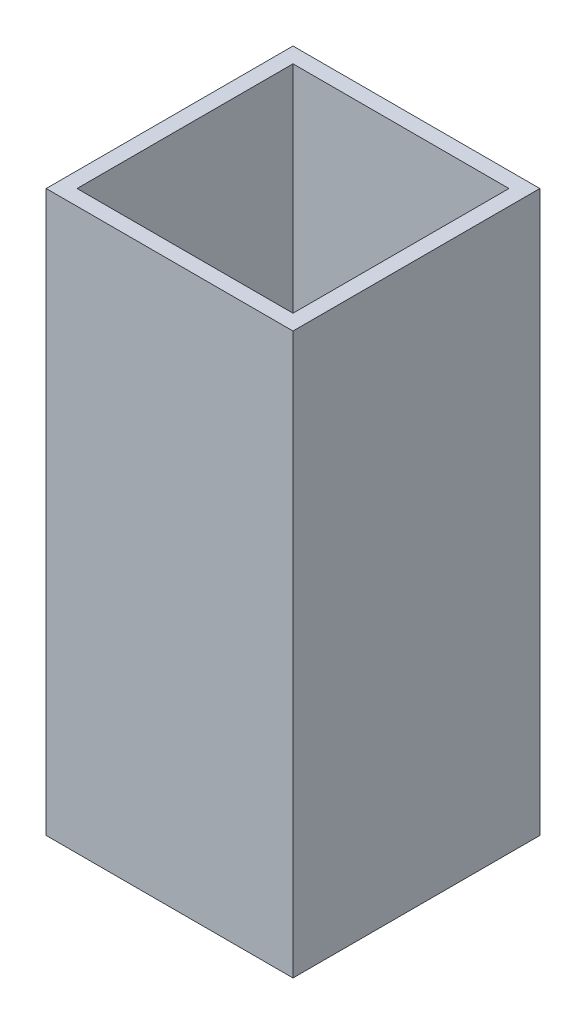
ISO-10303-21;
HEADER;
FILE_DESCRIPTION(('STEP AP214'),'2;1');
FILE_NAME('part.step','',(''),(''),'','','');
FILE_SCHEMA(('AUTOMOTIVE_DESIGN { 1 0 10303 214 1 1 1 1 }'));
ENDSEC;
DATA;
#1=APPLICATION_CONTEXT('core data for automotive mechanical design processes');
#2=APPLICATION_PROTOCOL_DEFINITION('international standard','automotive_design',2000,#1);
#3=PRODUCT_CONTEXT('',#1,'mechanical');
#4=PRODUCT('Part','Part','',(#3));
#5=PRODUCT_RELATED_PRODUCT_CATEGORY('part','',(#4));
#6=PRODUCT_DEFINITION_FORMATION('','',#4);
#7=PRODUCT_DEFINITION_CONTEXT('part definition',#1,'design');
#8=PRODUCT_DEFINITION('design','',#6,#7);
#9=PRODUCT_DEFINITION_SHAPE('','',#8);
#10=(LENGTH_UNIT() NAMED_UNIT(*) SI_UNIT(.MILLI.,.METRE.));
#11=(NAMED_UNIT(*) PLANE_ANGLE_UNIT() SI_UNIT($,.RADIAN.));
#12=(NAMED_UNIT(*) SI_UNIT($,.STERADIAN.) SOLID_ANGLE_UNIT());
#13=UNCERTAINTY_MEASURE_WITH_UNIT(LENGTH_MEASURE(1.E-05),#10,'distance_accuracy_value','');
#14=(GEOMETRIC_REPRESENTATION_CONTEXT(3) GLOBAL_UNCERTAINTY_ASSIGNED_CONTEXT((#13)) GLOBAL_UNIT_ASSIGNED_CONTEXT((#10,
#11,#12)) REPRESENTATION_CONTEXT('',''));
#15=CARTESIAN_POINT('',(0.,0.,0.));
#16=DIRECTION('',(0.,0.,1.));
#17=DIRECTION('',(1.,0.,0.));
#18=AXIS2_PLACEMENT_3D('',#15,#16,#17);
#19=CARTESIAN_POINT('',(0.,57.658,0.));
#20=DIRECTION('',(0.,-1.,0.));
#21=DIRECTION('',(0.,0.,-1.));
#22=AXIS2_PLACEMENT_3D('',#19,#20,#21);
#23=PLANE('',#22);
#24=DIRECTION('',(0.,0.,-1.));
#25=VECTOR('',#24,1.);
#26=CARTESIAN_POINT('',(12.7,57.658,12.7));
#27=LINE('',#26,#25);
#28=CARTESIAN_POINT('',(12.7,57.658,12.7));
#29=VERTEX_POINT('',#28);
#30=CARTESIAN_POINT('',(12.7,57.658,-12.7));
#31=VERTEX_POINT('',#30);
#32=EDGE_CURVE('E136',#29,#31,#27,.T.);
#33=ORIENTED_EDGE('',*,*,#32,.T.);
#34=DIRECTION('',(-1.,0.,0.));
#35=VECTOR('',#34,1.);
#36=CARTESIAN_POINT('',(-12.7,57.658,-12.7));
#37=LINE('',#36,#35);
#38=CARTESIAN_POINT('',(-12.7,57.658,-12.7));
#39=VERTEX_POINT('',#38);
#40=EDGE_CURVE('E139',#31,#39,#37,.T.);
#41=ORIENTED_EDGE('',*,*,#40,.T.);
#42=DIRECTION('',(0.,0.,1.));
#43=VECTOR('',#42,1.);
#44=CARTESIAN_POINT('',(-12.7,57.658,12.7));
#45=LINE('',#44,#43);
#46=CARTESIAN_POINT('',(-12.7,57.658,12.7));
#47=VERTEX_POINT('',#46);
#48=EDGE_CURVE('E142',#39,#47,#45,.T.);
#49=ORIENTED_EDGE('',*,*,#48,.T.);
#50=DIRECTION('',(1.,0.,0.));
#51=VECTOR('',#50,1.);
#52=CARTESIAN_POINT('',(-12.7,57.658,12.7));
#53=LINE('',#52,#51);
#54=EDGE_CURVE('E144',#47,#29,#53,.T.);
#55=ORIENTED_EDGE('',*,*,#54,.T.);
#56=EDGE_LOOP('',(#33,#41,#49,#55));
#57=FACE_BOUND('',#56,.T.);
#58=DIRECTION('',(0.,0.,-1.));
#59=VECTOR('',#58,1.);
#60=CARTESIAN_POINT('',(11.1125,57.658,11.1125));
#61=LINE('',#60,#59);
#62=CARTESIAN_POINT('',(11.1125,57.658,11.1125));
#63=VERTEX_POINT('',#62);
#64=CARTESIAN_POINT('',(11.1125,57.658,-11.1125));
#65=VERTEX_POINT('',#64);
#66=EDGE_CURVE('E100',#63,#65,#61,.T.);
#67=ORIENTED_EDGE('',*,*,#66,.F.);
#68=DIRECTION('',(1.,0.,0.));
#69=VECTOR('',#68,1.);
#70=CARTESIAN_POINT('',(-11.1125,57.658,11.1125));
#71=LINE('',#70,#69);
#72=CARTESIAN_POINT('',(-11.1125,57.658,11.1125));
#73=VERTEX_POINT('',#72);
#74=EDGE_CURVE('E122',#73,#63,#71,.T.);
#75=ORIENTED_EDGE('',*,*,#74,.F.);
#76=DIRECTION('',(0.,0.,1.));
#77=VECTOR('',#76,1.);
#78=CARTESIAN_POINT('',(-11.1125,57.658,11.1125));
#79=LINE('',#78,#77);
#80=CARTESIAN_POINT('',(-11.1125,57.658,-11.1125));
#81=VERTEX_POINT('',#80);
#82=EDGE_CURVE('E120',#81,#73,#79,.T.);
#83=ORIENTED_EDGE('',*,*,#82,.F.);
#84=DIRECTION('',(-1.,0.,0.));
#85=VECTOR('',#84,1.);
#86=CARTESIAN_POINT('',(-11.1125,57.658,-11.1125));
#87=LINE('',#86,#85);
#88=EDGE_CURVE('E108',#65,#81,#87,.T.);
#89=ORIENTED_EDGE('',*,*,#88,.F.);
#90=EDGE_LOOP('',(#67,#75,#83,#89));
#91=FACE_BOUND('',#90,.T.);
#92=ADVANCED_FACE('F35',(#57,#91),#23,.F.);
#93=CARTESIAN_POINT('',(0.,0.,0.));
#94=DIRECTION('',(0.,-1.,0.));
#95=DIRECTION('',(0.,0.,-1.));
#96=AXIS2_PLACEMENT_3D('',#93,#94,#95);
#97=PLANE('',#96);
#98=DIRECTION('',(0.,0.,-1.));
#99=VECTOR('',#98,1.);
#100=CARTESIAN_POINT('',(12.7,0.,12.7));
#101=LINE('',#100,#99);
#102=CARTESIAN_POINT('',(12.7,0.,12.7));
#103=VERTEX_POINT('',#102);
#104=CARTESIAN_POINT('',(12.7,0.,-12.7));
#105=VERTEX_POINT('',#104);
#106=EDGE_CURVE('E116',#103,#105,#101,.T.);
#107=ORIENTED_EDGE('',*,*,#106,.F.);
#108=DIRECTION('',(1.,0.,0.));
#109=VECTOR('',#108,1.);
#110=CARTESIAN_POINT('',(-12.7,0.,12.7));
#111=LINE('',#110,#109);
#112=CARTESIAN_POINT('',(-12.7,0.,12.7));
#113=VERTEX_POINT('',#112);
#114=EDGE_CURVE('E140',#113,#103,#111,.T.);
#115=ORIENTED_EDGE('',*,*,#114,.F.);
#116=DIRECTION('',(0.,0.,1.));
#117=VECTOR('',#116,1.);
#118=CARTESIAN_POINT('',(-12.7,0.,12.7));
#119=LINE('',#118,#117);
#120=CARTESIAN_POINT('',(-12.7,0.,-12.7));
#121=VERTEX_POINT('',#120);
#122=EDGE_CURVE('E151',#121,#113,#119,.T.);
#123=ORIENTED_EDGE('',*,*,#122,.F.);
#124=DIRECTION('',(-1.,0.,0.));
#125=VECTOR('',#124,1.);
#126=CARTESIAN_POINT('',(-12.7,0.,-12.7));
#127=LINE('',#126,#125);
#128=EDGE_CURVE('E149',#105,#121,#127,.T.);
#129=ORIENTED_EDGE('',*,*,#128,.F.);
#130=EDGE_LOOP('',(#107,#115,#123,#129));
#131=FACE_BOUND('',#130,.T.);
#132=DIRECTION('',(1.,0.,0.));
#133=VECTOR('',#132,1.);
#134=CARTESIAN_POINT('',(-11.1125,0.,11.1125));
#135=LINE('',#134,#133);
#136=CARTESIAN_POINT('',(-11.1125,0.,11.1125));
#137=VERTEX_POINT('',#136);
#138=CARTESIAN_POINT('',(11.1125,0.,11.1125));
#139=VERTEX_POINT('',#138);
#140=EDGE_CURVE('E109',#137,#139,#135,.T.);
#141=ORIENTED_EDGE('',*,*,#140,.T.);
#142=DIRECTION('',(0.,0.,-1.));
#143=VECTOR('',#142,1.);
#144=CARTESIAN_POINT('',(11.1125,0.,11.1125));
#145=LINE('',#144,#143);
#146=CARTESIAN_POINT('',(11.1125,0.,-11.1125));
#147=VERTEX_POINT('',#146);
#148=EDGE_CURVE('E58',#139,#147,#145,.T.);
#149=ORIENTED_EDGE('',*,*,#148,.T.);
#150=DIRECTION('',(-1.,0.,0.));
#151=VECTOR('',#150,1.);
#152=CARTESIAN_POINT('',(-11.1125,0.,-11.1125));
#153=LINE('',#152,#151);
#154=CARTESIAN_POINT('',(-11.1125,0.,-11.1125));
#155=VERTEX_POINT('',#154);
#156=EDGE_CURVE('E115',#147,#155,#153,.T.);
#157=ORIENTED_EDGE('',*,*,#156,.T.);
#158=DIRECTION('',(0.,0.,1.));
#159=VECTOR('',#158,1.);
#160=CARTESIAN_POINT('',(-11.1125,0.,11.1125));
#161=LINE('',#160,#159);
#162=EDGE_CURVE('E128',#155,#137,#161,.T.);
#163=ORIENTED_EDGE('',*,*,#162,.T.);
#164=EDGE_LOOP('',(#141,#149,#157,#163));
#165=FACE_BOUND('',#164,.T.);
#166=ADVANCED_FACE('F169',(#131,#165),#97,.T.);
#167=CARTESIAN_POINT('',(12.7,57.658,12.7));
#168=DIRECTION('',(-1.,0.,0.));
#169=DIRECTION('',(0.,0.,1.));
#170=AXIS2_PLACEMENT_3D('',#167,#168,#169);
#171=PLANE('',#170);
#172=ORIENTED_EDGE('',*,*,#106,.T.);
#173=DIRECTION('',(0.,-1.,0.));
#174=VECTOR('',#173,1.);
#175=CARTESIAN_POINT('',(12.7,57.658,-12.7));
#176=LINE('',#175,#174);
#177=EDGE_CURVE('E11',#31,#105,#176,.T.);
#178=ORIENTED_EDGE('',*,*,#177,.F.);
#179=ORIENTED_EDGE('',*,*,#32,.F.);
#180=DIRECTION('',(0.,-1.,0.));
#181=VECTOR('',#180,1.);
#182=CARTESIAN_POINT('',(12.7,57.658,12.7));
#183=LINE('',#182,#181);
#184=EDGE_CURVE('E146',#29,#103,#183,.T.);
#185=ORIENTED_EDGE('',*,*,#184,.T.);
#186=EDGE_LOOP('',(#172,#178,#179,#185));
#187=FACE_BOUND('',#186,.T.);
#188=ADVANCED_FACE('F37',(#187),#171,.F.);
#189=CARTESIAN_POINT('',(-12.7,57.658,-12.7));
#190=DIRECTION('',(0.,0.,1.));
#191=DIRECTION('',(1.,0.,0.));
#192=AXIS2_PLACEMENT_3D('',#189,#190,#191);
#193=PLANE('',#192);
#194=ORIENTED_EDGE('',*,*,#128,.T.);
#195=DIRECTION('',(0.,-1.,0.));
#196=VECTOR('',#195,1.);
#197=CARTESIAN_POINT('',(-12.7,57.658,-12.7));
#198=LINE('',#197,#196);
#199=EDGE_CURVE('E43',#39,#121,#198,.T.);
#200=ORIENTED_EDGE('',*,*,#199,.F.);
#201=ORIENTED_EDGE('',*,*,#40,.F.);
#202=ORIENTED_EDGE('',*,*,#177,.T.);
#203=EDGE_LOOP('',(#194,#200,#201,#202));
#204=FACE_BOUND('',#203,.T.);
#205=ADVANCED_FACE('F179',(#204),#193,.F.);
#206=CARTESIAN_POINT('',(-12.7,57.658,12.7));
#207=DIRECTION('',(1.,0.,0.));
#208=DIRECTION('',(0.,0.,-1.));
#209=AXIS2_PLACEMENT_3D('',#206,#207,#208);
#210=PLANE('',#209);
#211=ORIENTED_EDGE('',*,*,#122,.T.);
#212=DIRECTION('',(0.,-1.,0.));
#213=VECTOR('',#212,1.);
#214=CARTESIAN_POINT('',(-12.7,57.658,12.7));
#215=LINE('',#214,#213);
#216=EDGE_CURVE('E156',#47,#113,#215,.T.);
#217=ORIENTED_EDGE('',*,*,#216,.F.);
#218=ORIENTED_EDGE('',*,*,#48,.F.);
#219=ORIENTED_EDGE('',*,*,#199,.T.);
#220=EDGE_LOOP('',(#211,#217,#218,#219));
#221=FACE_BOUND('',#220,.T.);
#222=ADVANCED_FACE('F163',(#221),#210,.F.);
#223=CARTESIAN_POINT('',(-12.7,57.658,12.7));
#224=DIRECTION('',(0.,0.,-1.));
#225=DIRECTION('',(-1.,0.,0.));
#226=AXIS2_PLACEMENT_3D('',#223,#224,#225);
#227=PLANE('',#226);
#228=ORIENTED_EDGE('',*,*,#114,.T.);
#229=ORIENTED_EDGE('',*,*,#184,.F.);
#230=ORIENTED_EDGE('',*,*,#54,.F.);
#231=ORIENTED_EDGE('',*,*,#216,.T.);
#232=EDGE_LOOP('',(#228,#229,#230,#231));
#233=FACE_BOUND('',#232,.T.);
#234=ADVANCED_FACE('F173',(#233),#227,.F.);
#235=CARTESIAN_POINT('',(11.1125,57.658,11.1125));
#236=DIRECTION('',(-1.,0.,0.));
#237=DIRECTION('',(0.,0.,1.));
#238=AXIS2_PLACEMENT_3D('',#235,#236,#237);
#239=PLANE('',#238);
#240=ORIENTED_EDGE('',*,*,#148,.F.);
#241=DIRECTION('',(0.,-1.,0.));
#242=VECTOR('',#241,1.);
#243=CARTESIAN_POINT('',(11.1125,57.658,11.1125));
#244=LINE('',#243,#242);
#245=EDGE_CURVE('E104',#63,#139,#244,.T.);
#246=ORIENTED_EDGE('',*,*,#245,.F.);
#247=ORIENTED_EDGE('',*,*,#66,.T.);
#248=DIRECTION('',(0.,-1.,0.));
#249=VECTOR('',#248,1.);
#250=CARTESIAN_POINT('',(11.1125,57.658,-11.1125));
#251=LINE('',#250,#249);
#252=EDGE_CURVE('E103',#65,#147,#251,.T.);
#253=ORIENTED_EDGE('',*,*,#252,.T.);
#254=EDGE_LOOP('',(#240,#246,#247,#253));
#255=FACE_BOUND('',#254,.T.);
#256=ADVANCED_FACE('F102',(#255),#239,.T.);
#257=CARTESIAN_POINT('',(-11.1125,57.658,-11.1125));
#258=DIRECTION('',(0.,0.,1.));
#259=DIRECTION('',(1.,0.,0.));
#260=AXIS2_PLACEMENT_3D('',#257,#258,#259);
#261=PLANE('',#260);
#262=ORIENTED_EDGE('',*,*,#156,.F.);
#263=ORIENTED_EDGE('',*,*,#252,.F.);
#264=ORIENTED_EDGE('',*,*,#88,.T.);
#265=DIRECTION('',(0.,-1.,0.));
#266=VECTOR('',#265,1.);
#267=CARTESIAN_POINT('',(-11.1125,57.658,-11.1125));
#268=LINE('',#267,#266);
#269=EDGE_CURVE('E117',#81,#155,#268,.T.);
#270=ORIENTED_EDGE('',*,*,#269,.T.);
#271=EDGE_LOOP('',(#262,#263,#264,#270));
#272=FACE_BOUND('',#271,.T.);
#273=ADVANCED_FACE('F112',(#272),#261,.T.);
#274=CARTESIAN_POINT('',(-11.1125,57.658,11.1125));
#275=DIRECTION('',(1.,0.,0.));
#276=DIRECTION('',(0.,0.,-1.));
#277=AXIS2_PLACEMENT_3D('',#274,#275,#276);
#278=PLANE('',#277);
#279=ORIENTED_EDGE('',*,*,#162,.F.);
#280=ORIENTED_EDGE('',*,*,#269,.F.);
#281=ORIENTED_EDGE('',*,*,#82,.T.);
#282=DIRECTION('',(0.,-1.,0.));
#283=VECTOR('',#282,1.);
#284=CARTESIAN_POINT('',(-11.1125,57.658,11.1125));
#285=LINE('',#284,#283);
#286=EDGE_CURVE('E50',#73,#137,#285,.T.);
#287=ORIENTED_EDGE('',*,*,#286,.T.);
#288=EDGE_LOOP('',(#279,#280,#281,#287));
#289=FACE_BOUND('',#288,.T.);
#290=ADVANCED_FACE('F202',(#289),#278,.T.);
#291=CARTESIAN_POINT('',(-11.1125,57.658,11.1125));
#292=DIRECTION('',(0.,0.,-1.));
#293=DIRECTION('',(-1.,0.,0.));
#294=AXIS2_PLACEMENT_3D('',#291,#292,#293);
#295=PLANE('',#294);
#296=ORIENTED_EDGE('',*,*,#140,.F.);
#297=ORIENTED_EDGE('',*,*,#286,.F.);
#298=ORIENTED_EDGE('',*,*,#74,.T.);
#299=ORIENTED_EDGE('',*,*,#245,.T.);
#300=EDGE_LOOP('',(#296,#297,#298,#299));
#301=FACE_BOUND('',#300,.T.);
#302=ADVANCED_FACE('F206',(#301),#295,.T.);
#303=CLOSED_SHELL('',(#92,#166,#188,#205,#222,#234,#256,#273,#290,#302));
#304=MANIFOLD_SOLID_BREP('B2',#303);
#305=ADVANCED_BREP_SHAPE_REPRESENTATION('',(#18,#304),#14);
#306=SHAPE_DEFINITION_REPRESENTATION(#9,#305);
ENDSEC;
END-ISO-10303-21;
